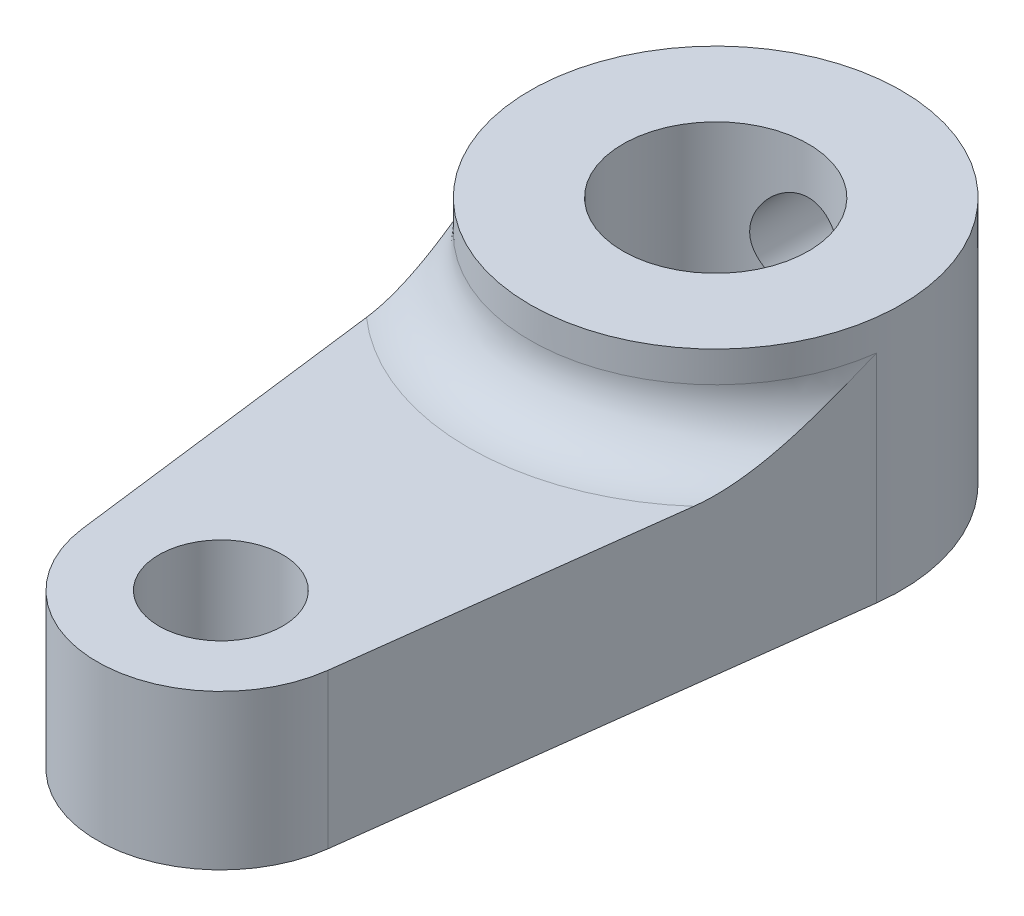
ISO-10303-21;
HEADER;
FILE_DESCRIPTION(('STEP AP214'),'2;1');
FILE_NAME('part.step','',(''),(''),'','','');
FILE_SCHEMA(('AUTOMOTIVE_DESIGN { 1 0 10303 214 1 1 1 1 }'));
ENDSEC;
DATA;
#1=APPLICATION_CONTEXT('core data for automotive mechanical design processes');
#2=APPLICATION_PROTOCOL_DEFINITION('international standard','automotive_design',2000,#1);
#3=PRODUCT_CONTEXT('',#1,'mechanical');
#4=PRODUCT('Part','Part','',(#3));
#5=PRODUCT_RELATED_PRODUCT_CATEGORY('part','',(#4));
#6=PRODUCT_DEFINITION_FORMATION('','',#4);
#7=PRODUCT_DEFINITION_CONTEXT('part definition',#1,'design');
#8=PRODUCT_DEFINITION('design','',#6,#7);
#9=PRODUCT_DEFINITION_SHAPE('','',#8);
#10=(LENGTH_UNIT() NAMED_UNIT(*) SI_UNIT(.MILLI.,.METRE.));
#11=(NAMED_UNIT(*) PLANE_ANGLE_UNIT() SI_UNIT($,.RADIAN.));
#12=(NAMED_UNIT(*) SI_UNIT($,.STERADIAN.) SOLID_ANGLE_UNIT());
#13=UNCERTAINTY_MEASURE_WITH_UNIT(LENGTH_MEASURE(1.E-05),#10,'distance_accuracy_value','');
#14=(GEOMETRIC_REPRESENTATION_CONTEXT(3) GLOBAL_UNCERTAINTY_ASSIGNED_CONTEXT((#13)) GLOBAL_UNIT_ASSIGNED_CONTEXT((#10,
#11,#12)) REPRESENTATION_CONTEXT('',''));
#15=CARTESIAN_POINT('',(0.,0.,0.));
#16=DIRECTION('',(0.,0.,1.));
#17=DIRECTION('',(1.,0.,0.));
#18=AXIS2_PLACEMENT_3D('',#15,#16,#17);
#19=CARTESIAN_POINT('',(-5.95294044989533,5.,0.750000000000001));
#20=DIRECTION('',(0.992156741649222,0.,-0.125));
#21=DIRECTION('',(-0.125,0.,-0.992156741649222));
#22=AXIS2_PLACEMENT_3D('',#19,#20,#21);
#23=PLANE('',#22);
#24=DIRECTION('',(0.125,0.,0.992156741649222));
#25=VECTOR('',#24,1.);
#26=CARTESIAN_POINT('',(-5.95294044989533,0.,0.750000000000001));
#27=LINE('',#26,#25);
#28=CARTESIAN_POINT('',(-5.95294044989533,0.,0.750000000000001));
#29=VERTEX_POINT('',#28);
#30=CARTESIAN_POINT('',(-3.96862696659688,0.,16.5));
#31=VERTEX_POINT('',#30);
#32=EDGE_CURVE('E177',#29,#31,#27,.T.);
#33=ORIENTED_EDGE('',*,*,#32,.T.);
#34=DIRECTION('',(0.,-1.,0.));
#35=VECTOR('',#34,1.);
#36=CARTESIAN_POINT('',(-3.96862696659688,5.,16.5));
#37=LINE('',#36,#35);
#38=CARTESIAN_POINT('',(-3.96862696659688,5.,16.5));
#39=VERTEX_POINT('',#38);
#40=EDGE_CURVE('E169',#39,#31,#37,.T.);
#41=ORIENTED_EDGE('',*,*,#40,.F.);
#42=DIRECTION('',(0.125,0.,0.992156741649222));
#43=VECTOR('',#42,1.);
#44=CARTESIAN_POINT('',(-5.95294044989533,5.,0.750000000000001));
#45=LINE('',#44,#43);
#46=CARTESIAN_POINT('',(-5.29150262212918,5.,6.00000000000001));
#47=VERTEX_POINT('',#46);
#48=EDGE_CURVE('E153',#47,#39,#45,.T.);
#49=ORIENTED_EDGE('',*,*,#48,.F.);
#50=CARTESIAN_POINT('',(-5.29150262212918,5.,6.));
#51=CARTESIAN_POINT('',(-5.31039781985104,5.00003932371851,5.85002401756371));
#52=CARTESIAN_POINT('',(-5.32927068108457,5.00749080861607,5.70022532550723));
#53=CARTESIAN_POINT('',(-5.3668298397168,5.03529748814452,5.40210874592607));
#54=CARTESIAN_POINT('',(-5.38551644968376,5.05562506504888,5.25378837746783));
#55=CARTESIAN_POINT('',(-5.42237695613113,5.10690972129888,4.96121717768887));
#56=CARTESIAN_POINT('',(-5.44055436264548,5.13771036698757,4.81693848633762));
#57=CARTESIAN_POINT('',(-5.47663555915596,5.20848018103613,4.53055286742049));
#58=CARTESIAN_POINT('',(-5.49453918362415,5.24845467894681,4.38844725369187));
#59=CARTESIAN_POINT('',(-5.55104862359349,5.38804779430905,3.93991747903271));
#60=CARTESIAN_POINT('',(-5.58909054596898,5.50228369716573,3.63796908103157));
#61=CARTESIAN_POINT('',(-5.66384180156036,5.75580816906752,3.04464938357773));
#62=CARTESIAN_POINT('',(-5.70054954085287,5.89512559194067,2.75329073549964));
#63=CARTESIAN_POINT('',(-5.80963672037306,6.33812108028194,1.88743809079183));
#64=CARTESIAN_POINT('',(-5.88048240155207,6.6653306727669,1.32511792920347));
#65=CARTESIAN_POINT('',(-5.95182241893323,6.99483605454595,0.758874095651361));
#66=CARTESIAN_POINT('',(-5.95238143594605,6.99741804396554,0.754437035667611));
#67=CARTESIAN_POINT('',(-5.95294044989533,7.,0.750000000000001));
#68=B_SPLINE_CURVE_WITH_KNOTS('',3,(#50,#51,#52,#53,#54,#55,#56,#57,#58,#59,#60,#61,#62,#63,#64,
#65,#66,#67),.UNSPECIFIED.,.F.,.F.,(4,2,2,2,2,2,2,2,4),(0.,0.453047985174652,0.905127510169083,
1.35073120961699,1.79659444088085,2.76988627914147,3.74430503334612,5.70583133706968,
5.72132327058451),.UNSPECIFIED.);
#69=CARTESIAN_POINT('',(-5.95294044989533,7.,0.750000000000001));
#70=VERTEX_POINT('',#69);
#71=EDGE_CURVE('E55',#47,#70,#68,.T.);
#72=ORIENTED_EDGE('',*,*,#71,.T.);
#73=DIRECTION('',(0.,-1.,0.));
#74=VECTOR('',#73,1.);
#75=CARTESIAN_POINT('',(-5.95294044989533,5.,0.750000000000001));
#76=LINE('',#75,#74);
#77=EDGE_CURVE('E357',#70,#29,#76,.T.);
#78=ORIENTED_EDGE('',*,*,#77,.T.);
#79=EDGE_LOOP('',(#33,#41,#49,#72,#78));
#80=FACE_BOUND('',#79,.T.);
#81=ADVANCED_FACE('F101',(#80),#23,.F.);
#82=CARTESIAN_POINT('',(0.,5.,16.));
#83=DIRECTION('',(0.,-1.,0.));
#84=DIRECTION('',(0.,0.,-1.));
#85=AXIS2_PLACEMENT_3D('',#82,#83,#84);
#86=CYLINDRICAL_SURFACE('',#85,4.);
#87=CARTESIAN_POINT('',(0.,0.,16.));
#88=DIRECTION('',(0.,1.,0.));
#89=DIRECTION('',(0.,0.,1.));
#90=AXIS2_PLACEMENT_3D('',#87,#88,#89);
#91=CIRCLE('',#90,4.);
#92=CARTESIAN_POINT('',(3.96862696659689,0.,16.5));
#93=VERTEX_POINT('',#92);
#94=EDGE_CURVE('E360',#31,#93,#91,.T.);
#95=ORIENTED_EDGE('',*,*,#94,.T.);
#96=DIRECTION('',(0.,-1.,0.));
#97=VECTOR('',#96,1.);
#98=CARTESIAN_POINT('',(3.96862696659689,5.,16.5));
#99=LINE('',#98,#97);
#100=CARTESIAN_POINT('',(3.96862696659689,5.,16.5));
#101=VERTEX_POINT('',#100);
#102=EDGE_CURVE('E171',#101,#93,#99,.T.);
#103=ORIENTED_EDGE('',*,*,#102,.F.);
#104=CARTESIAN_POINT('',(0.,5.,16.));
#105=DIRECTION('',(0.,1.,0.));
#106=DIRECTION('',(0.,0.,1.));
#107=AXIS2_PLACEMENT_3D('',#104,#105,#106);
#108=CIRCLE('',#107,4.);
#109=EDGE_CURVE('E157',#39,#101,#108,.T.);
#110=ORIENTED_EDGE('',*,*,#109,.F.);
#111=ORIENTED_EDGE('',*,*,#40,.T.);
#112=EDGE_LOOP('',(#95,#103,#110,#111));
#113=FACE_BOUND('',#112,.T.);
#114=ADVANCED_FACE('F168',(#113),#86,.T.);
#115=CARTESIAN_POINT('',(5.95294044989533,5.,0.75));
#116=DIRECTION('',(0.992156741649222,0.,0.125));
#117=DIRECTION('',(0.125,0.,-0.992156741649222));
#118=AXIS2_PLACEMENT_3D('',#115,#116,#117);
#119=PLANE('',#118);
#120=DIRECTION('',(-0.125,0.,0.992156741649222));
#121=VECTOR('',#120,1.);
#122=CARTESIAN_POINT('',(5.95294044989533,0.,0.75));
#123=LINE('',#122,#121);
#124=CARTESIAN_POINT('',(5.95294044989533,0.,0.749999999999999));
#125=VERTEX_POINT('',#124);
#126=EDGE_CURVE('E363',#125,#93,#123,.T.);
#127=ORIENTED_EDGE('',*,*,#126,.F.);
#128=DIRECTION('',(0.,-1.,0.));
#129=VECTOR('',#128,1.);
#130=CARTESIAN_POINT('',(5.95294044989533,5.,0.749999999999999));
#131=LINE('',#130,#129);
#132=CARTESIAN_POINT('',(5.95294044989533,7.,0.749999999999999));
#133=VERTEX_POINT('',#132);
#134=EDGE_CURVE('E185',#133,#125,#131,.T.);
#135=ORIENTED_EDGE('',*,*,#134,.F.);
#136=CARTESIAN_POINT('',(5.29150262212918,5.,6.));
#137=CARTESIAN_POINT('',(5.31039781985099,5.00003932371851,5.85002401756408));
#138=CARTESIAN_POINT('',(5.32927068108448,5.00749080861603,5.70022532550798));
#139=CARTESIAN_POINT('',(5.36682983971663,5.03529748814436,5.40210874592749));
#140=CARTESIAN_POINT('',(5.38551644968354,5.05562506504863,5.25378837746954));
#141=CARTESIAN_POINT('',(5.42237695613093,5.10690972129854,4.96121717769049));
#142=CARTESIAN_POINT('',(5.44055436264532,5.13771036698727,4.81693848633887));
#143=CARTESIAN_POINT('',(5.47663555915588,5.20848018103597,4.53055286742109));
#144=CARTESIAN_POINT('',(5.49453918362412,5.24845467894676,4.38844725369219));
#145=CARTESIAN_POINT('',(5.55104862359351,5.388047794309,3.93991747903255));
#146=CARTESIAN_POINT('',(5.58909054596904,5.50228369716535,3.6379690810311));
#147=CARTESIAN_POINT('',(5.6638418015604,5.75580816906824,3.0446493835774));
#148=CARTESIAN_POINT('',(5.70054954085285,5.89512559194285,2.75329073549978));
#149=CARTESIAN_POINT('',(5.80963672037343,6.33812108027884,1.88743809078903));
#150=CARTESIAN_POINT('',(5.88048240155358,6.66533067274761,1.32511792919187));
#151=CARTESIAN_POINT('',(5.95182241893326,6.99483605454567,0.75887409565114));
#152=CARTESIAN_POINT('',(5.95238143594606,6.9974180439654,0.7544370356675));
#153=CARTESIAN_POINT('',(5.95294044989533,7.,0.75));
#154=B_SPLINE_CURVE_WITH_KNOTS('',3,(#136,#137,#138,#139,#140,#141,#142,#143,#144,#145,#146,
#147,#148,#149,#150,#151,#152,#153),.UNSPECIFIED.,.F.,.F.,(4,2,2,2,2,2,2,2,4),(0.,
0.453047985173508,0.905127510167047,1.35073120961605,1.79659444088085,2.7698862791418,
3.74430503334741,5.70583133706976,5.72132327058452),.UNSPECIFIED.);
#155=CARTESIAN_POINT('',(5.29150262212918,5.,6.));
#156=VERTEX_POINT('',#155);
#157=EDGE_CURVE('E117',#133,#156,#154,.F.);
#158=ORIENTED_EDGE('',*,*,#157,.T.);
#159=DIRECTION('',(-0.125,0.,0.992156741649222));
#160=VECTOR('',#159,1.);
#161=CARTESIAN_POINT('',(5.95294044989533,5.,0.75));
#162=LINE('',#161,#160);
#163=EDGE_CURVE('E173',#156,#101,#162,.T.);
#164=ORIENTED_EDGE('',*,*,#163,.T.);
#165=ORIENTED_EDGE('',*,*,#102,.T.);
#166=EDGE_LOOP('',(#127,#135,#158,#164,#165));
#167=FACE_BOUND('',#166,.T.);
#168=ADVANCED_FACE('F201',(#167),#119,.T.);
#169=CARTESIAN_POINT('',(0.,5.,0.));
#170=DIRECTION('',(0.,-1.,0.));
#171=DIRECTION('',(0.,0.,-1.));
#172=AXIS2_PLACEMENT_3D('',#169,#170,#171);
#173=CYLINDRICAL_SURFACE('',#172,6.);
#174=CARTESIAN_POINT('',(0.,6.5,-6.));
#175=CARTESIAN_POINT('',(-0.082876088669731,6.49999767426184,-5.99999859868013));
#176=CARTESIAN_POINT('',(-0.165778157830763,6.49310844922621,-5.99826578131828));
#177=CARTESIAN_POINT('',(-0.329206323770532,6.46577484869299,-5.99152113829892));
#178=CARTESIAN_POINT('',(-0.409731046870739,6.44532279046215,-5.98650745419968));
#179=CARTESIAN_POINT('',(-0.566020872182576,6.39156074653791,-5.9737562633204));
#180=CARTESIAN_POINT('',(-0.641791563430002,6.35826620128472,-5.96602202842087));
#181=CARTESIAN_POINT('',(-0.786672131904425,6.27981860995517,-5.94865343807593));
#182=CARTESIAN_POINT('',(-0.855781784348758,6.23466516388106,-5.9390190185405));
#183=CARTESIAN_POINT('',(-0.986801927300918,6.13279921034579,-5.91867413591801));
#184=CARTESIAN_POINT('',(-1.04855569006107,6.07588842504082,-5.90794707148533));
#185=CARTESIAN_POINT('',(-1.1617489272033,5.95254779509108,-5.8867362011753));
#186=CARTESIAN_POINT('',(-1.21318723694913,5.8861168770535,-5.87625242288349));
#187=CARTESIAN_POINT('',(-1.30502654279903,5.74440477326256,-5.8565477569971));
#188=CARTESIAN_POINT('',(-1.34525221592536,5.6690067691896,-5.84734794470605));
#189=CARTESIAN_POINT('',(-1.41239690855053,5.51225158834164,-5.83149494812223));
#190=CARTESIAN_POINT('',(-1.43931805543933,5.43089536667424,-5.82484135672789));
#191=CARTESIAN_POINT('',(-1.47855483680429,5.26625650179752,-5.81500476717551));
#192=CARTESIAN_POINT('',(-1.49115226833334,5.1830451039502,-5.81175491075426));
#193=CARTESIAN_POINT('',(-1.50226177506785,5.01563143098602,-5.80889362537741));
#194=CARTESIAN_POINT('',(-1.50077614181798,4.93142931930139,-5.80928160448644));
#195=CARTESIAN_POINT('',(-1.48398652463928,4.76658419225552,-5.81359205496618));
#196=CARTESIAN_POINT('',(-1.46901834019052,4.6859043785349,-5.81742863001879));
#197=CARTESIAN_POINT('',(-1.4262241869031,4.52823894908871,-5.82806709676484));
#198=CARTESIAN_POINT('',(-1.39839730206942,4.45125359697102,-5.83486919970697));
#199=CARTESIAN_POINT('',(-1.33038947793715,4.30226198374793,-5.85075113904187));
#200=CARTESIAN_POINT('',(-1.29008666723291,4.23031382821045,-5.85985327469421));
#201=CARTESIAN_POINT('',(-1.19835627601495,4.09408129024316,-5.87929710846386));
#202=CARTESIAN_POINT('',(-1.14692674880884,4.02979825193274,-5.88963902334735));
#203=CARTESIAN_POINT('',(-1.03266342468122,3.9087963843056,-5.91075880539781));
#204=CARTESIAN_POINT('',(-0.969546258165858,3.85234550993865,-5.92154069477971));
#205=CARTESIAN_POINT('',(-0.834611917503699,3.7507787575361,-5.94205965578786));
#206=CARTESIAN_POINT('',(-0.762794477707943,3.70566322573644,-5.95179669549415));
#207=CARTESIAN_POINT('',(-0.612115888681391,3.62794941377562,-5.96917732094183));
#208=CARTESIAN_POINT('',(-0.533231393208623,3.59539465974557,-5.97681360127725));
#209=CARTESIAN_POINT('',(-0.370876008142882,3.54408269429043,-5.98907916991419));
#210=CARTESIAN_POINT('',(-0.287405999150484,3.52532284358186,-5.99370903339281));
#211=CARTESIAN_POINT('',(-0.120539970390027,3.50254243444116,-5.99935499271375));
#212=CARTESIAN_POINT('',(-0.0371967199882097,3.4981569739247,-6.00046053508279));
#213=CARTESIAN_POINT('',(0.129032874801508,3.50324900205549,-5.99918804814451));
#214=CARTESIAN_POINT('',(0.211919259644595,3.51272524279913,-5.99681033241847));
#215=CARTESIAN_POINT('',(0.373614268776491,3.54497090839138,-5.98889581127357));
#216=CARTESIAN_POINT('',(0.452465118968754,3.56754126347699,-5.98340634185811));
#217=CARTESIAN_POINT('',(0.605257292452511,3.62510708402845,-5.96988706634134));
#218=CARTESIAN_POINT('',(0.679198119032634,3.66010380431317,-5.96185700369892));
#219=CARTESIAN_POINT('',(0.821523134429846,3.74223612887473,-5.9439330792631));
#220=CARTESIAN_POINT('',(0.889785441835829,3.78957611239676,-5.93400867366932));
#221=CARTESIAN_POINT('',(1.01752661364324,3.89478990879697,-5.91344509187419));
#222=CARTESIAN_POINT('',(1.07700395897301,3.95266553961691,-5.90280579251705));
#223=CARTESIAN_POINT('',(1.18699056807273,4.07900196084447,-5.88168956960771));
#224=CARTESIAN_POINT('',(1.23724386762203,4.14768770300242,-5.87122304187281));
#225=CARTESIAN_POINT('',(1.3255107590127,4.29273263446572,-5.85192878377239));
#226=CARTESIAN_POINT('',(1.36352489415793,4.36909148295975,-5.84310098067026));
#227=CARTESIAN_POINT('',(1.42595142060929,4.52690572241308,-5.82818094734665));
#228=CARTESIAN_POINT('',(1.45044439665406,4.60832762834401,-5.82207255291906));
#229=CARTESIAN_POINT('',(1.48534565995378,4.77430963788911,-5.81326744090184));
#230=CARTESIAN_POINT('',(1.49575702747866,4.85886905103249,-5.81056997719936));
#231=CARTESIAN_POINT('',(1.50203859033399,5.0261210238552,-5.80894901203957));
#232=CARTESIAN_POINT('',(1.49831789778012,5.10879743512473,-5.80991932728264));
#233=CARTESIAN_POINT('',(1.47737727831287,5.27230388866798,-5.81527909007843));
#234=CARTESIAN_POINT('',(1.46015762268677,5.35313396801365,-5.81966846891857));
#235=CARTESIAN_POINT('',(1.41293131944279,5.51020845906541,-5.83131260682722));
#236=CARTESIAN_POINT('',(1.38300140468037,5.58647730524021,-5.83855015236309));
#237=CARTESIAN_POINT('',(1.31126491360507,5.73296538271369,-5.85507755724829));
#238=CARTESIAN_POINT('',(1.26945669003419,5.80318377318691,-5.86436770120773));
#239=CARTESIAN_POINT('',(1.17386774863714,5.93755462900202,-5.88425634263512));
#240=CARTESIAN_POINT('',(1.11980316291225,6.00150107342396,-5.89488264831757));
#241=CARTESIAN_POINT('',(1.00178937118973,6.11954704479541,-5.91608027246286));
#242=CARTESIAN_POINT('',(0.937837821261145,6.17364423011297,-5.9266515772706));
#243=CARTESIAN_POINT('',(0.80046758670259,6.27141130856461,-5.94677655647663));
#244=CARTESIAN_POINT('',(0.726898422316386,6.31487461367158,-5.95630833365868));
#245=CARTESIAN_POINT('',(0.573266059510476,6.38874746294053,-5.97304924975118));
#246=CARTESIAN_POINT('',(0.493207563436739,6.41916636064853,-5.98026005199781));
#247=CARTESIAN_POINT('',(0.344410253243472,6.46157183032965,-5.99048059565542));
#248=CARTESIAN_POINT('',(0.276380170908069,6.47595124305343,-5.99402585052691));
#249=CARTESIAN_POINT('',(0.138906071536283,6.49516594362194,-5.99878605231948));
#250=CARTESIAN_POINT('',(0.0694621612426163,6.5000019493053,-6.00000117450894));
#251=CARTESIAN_POINT('',(0.,6.5,-6.));
#252=B_SPLINE_CURVE_WITH_KNOTS('',3,(#174,#175,#176,#177,#178,#179,#180,#181,#182,#183,#184,
#185,#186,#187,#188,#189,#190,#191,#192,#193,#194,#195,#196,#197,#198,#199,#200,#201,#202,#203,
#204,#205,#206,#207,#208,#209,#210,#211,#212,#213,#214,#215,#216,#217,#218,#219,#220,#221,#222,
#223,#224,#225,#226,#227,#228,#229,#230,#231,#232,#233,#234,#235,#236,#237,#238,#239,#240,#241,
#242,#243,#244,#245,#246,#247,#248,#249,#250,#251),.UNSPECIFIED.,.T.,.F.,(4,2,2,2,2,2,2,2,2,2,2,
2,2,2,2,2,2,2,2,2,2,2,2,2,2,2,2,2,2,2,2,2,2,2,2,2,2,2,4),(0.,0.248373712471889,
0.496888237763899,0.745104902286104,0.993329940169327,1.24614435437139,1.49898729580062,
1.75558647545807,2.01214461169368,2.2635629509943,2.51494038112697,2.76022497007018,
3.00552703466038,3.25330527873879,3.50112690836162,3.75601500969019,4.01091089558247,
4.26668229009114,4.52240473688642,4.77158308949276,5.02073901112742,5.26620274514037,
5.5116912732229,5.76153587565351,6.01142363008018,6.26744509204475,6.52345518749507,
6.77792254614035,7.03233423252407,7.27943780398612,7.52653640956033,7.77216400559446,
8.017825681369,8.26989576409909,8.52202569770417,8.77872185499587,9.03523363821349,
9.24342242942148,9.45159556043038),.UNSPECIFIED.);
#253=CARTESIAN_POINT('',(0.,6.5,-6.));
#254=VERTEX_POINT('',#253);
#255=EDGE_CURVE('E106',#254,#254,#252,.T.);
#256=ORIENTED_EDGE('',*,*,#255,.T.);
#257=EDGE_LOOP('',(#256));
#258=FACE_BOUND('',#257,.T.);
#259=CARTESIAN_POINT('',(0.,7.,0.));
#260=DIRECTION('',(0.,1.,0.));
#261=DIRECTION('',(0.,0.,1.));
#262=AXIS2_PLACEMENT_3D('',#259,#260,#261);
#263=CIRCLE('',#262,6.);
#264=EDGE_CURVE('E179',#70,#133,#263,.T.);
#265=ORIENTED_EDGE('',*,*,#264,.T.);
#266=ORIENTED_EDGE('',*,*,#134,.T.);
#267=CARTESIAN_POINT('',(0.,0.,0.));
#268=DIRECTION('',(0.,1.,0.));
#269=DIRECTION('',(0.,0.,1.));
#270=AXIS2_PLACEMENT_3D('',#267,#268,#269);
#271=CIRCLE('',#270,6.);
#272=EDGE_CURVE('E367',#125,#29,#271,.T.);
#273=ORIENTED_EDGE('',*,*,#272,.T.);
#274=ORIENTED_EDGE('',*,*,#77,.F.);
#275=EDGE_LOOP('',(#265,#266,#273,#274));
#276=FACE_BOUND('',#275,.T.);
#277=CARTESIAN_POINT('',(0.,8.,0.));
#278=DIRECTION('',(0.,1.,0.));
#279=DIRECTION('',(0.,0.,1.));
#280=AXIS2_PLACEMENT_3D('',#277,#278,#279);
#281=CIRCLE('',#280,6.);
#282=CARTESIAN_POINT('',(0.,8.,6.));
#283=VERTEX_POINT('',#282);
#284=EDGE_CURVE('E344',#283,#283,#281,.T.);
#285=ORIENTED_EDGE('',*,*,#284,.F.);
#286=EDGE_LOOP('',(#285));
#287=FACE_BOUND('',#286,.T.);
#288=ADVANCED_FACE('F205',(#258,#276,#287),#173,.T.);
#289=CARTESIAN_POINT('',(0.,5.,16.));
#290=DIRECTION('',(0.,-1.,0.));
#291=DIRECTION('',(0.,0.,-1.));
#292=AXIS2_PLACEMENT_3D('',#289,#290,#291);
#293=CYLINDRICAL_SURFACE('',#292,2.);
#294=CARTESIAN_POINT('',(0.,5.,16.));
#295=DIRECTION('',(0.,1.,0.));
#296=DIRECTION('',(0.,0.,1.));
#297=AXIS2_PLACEMENT_3D('',#294,#295,#296);
#298=CIRCLE('',#297,2.);
#299=CARTESIAN_POINT('',(0.,5.,18.));
#300=VERTEX_POINT('',#299);
#301=EDGE_CURVE('E353',#300,#300,#298,.T.);
#302=ORIENTED_EDGE('',*,*,#301,.T.);
#303=EDGE_LOOP('',(#302));
#304=FACE_BOUND('',#303,.T.);
#305=CARTESIAN_POINT('',(0.,0.,16.));
#306=DIRECTION('',(0.,1.,0.));
#307=DIRECTION('',(0.,0.,1.));
#308=AXIS2_PLACEMENT_3D('',#305,#306,#307);
#309=CIRCLE('',#308,2.);
#310=CARTESIAN_POINT('',(0.,0.,18.));
#311=VERTEX_POINT('',#310);
#312=EDGE_CURVE('E163',#311,#311,#309,.T.);
#313=ORIENTED_EDGE('',*,*,#312,.F.);
#314=EDGE_LOOP('',(#313));
#315=FACE_BOUND('',#314,.T.);
#316=ADVANCED_FACE('F229',(#304,#315),#293,.F.);
#317=CARTESIAN_POINT('',(0.,5.,0.));
#318=DIRECTION('',(0.,1.,0.));
#319=DIRECTION('',(0.,0.,1.));
#320=AXIS2_PLACEMENT_3D('',#317,#318,#319);
#321=PLANE('',#320);
#322=ORIENTED_EDGE('',*,*,#163,.F.);
#323=CARTESIAN_POINT('',(0.,5.,0.));
#324=DIRECTION('',(0.,1.,0.));
#325=DIRECTION('',(0.,0.,1.));
#326=AXIS2_PLACEMENT_3D('',#323,#324,#325);
#327=CIRCLE('',#326,8.);
#328=EDGE_CURVE('E130',#156,#47,#327,.F.);
#329=ORIENTED_EDGE('',*,*,#328,.T.);
#330=ORIENTED_EDGE('',*,*,#48,.T.);
#331=ORIENTED_EDGE('',*,*,#109,.T.);
#332=EDGE_LOOP('',(#322,#329,#330,#331));
#333=FACE_BOUND('',#332,.T.);
#334=ORIENTED_EDGE('',*,*,#301,.F.);
#335=EDGE_LOOP('',(#334));
#336=FACE_BOUND('',#335,.T.);
#337=ADVANCED_FACE('F155',(#333,#336),#321,.T.);
#338=CARTESIAN_POINT('',(0.,0.,0.));
#339=DIRECTION('',(0.,1.,0.));
#340=DIRECTION('',(0.,0.,1.));
#341=AXIS2_PLACEMENT_3D('',#338,#339,#340);
#342=PLANE('',#341);
#343=CARTESIAN_POINT('',(0.,0.,0.));
#344=DIRECTION('',(0.,1.,0.));
#345=DIRECTION('',(0.,0.,1.));
#346=AXIS2_PLACEMENT_3D('',#343,#344,#345);
#347=CIRCLE('',#346,3.);
#348=CARTESIAN_POINT('',(0.,0.,3.));
#349=VERTEX_POINT('',#348);
#350=EDGE_CURVE('E340',#349,#349,#347,.T.);
#351=ORIENTED_EDGE('',*,*,#350,.T.);
#352=EDGE_LOOP('',(#351));
#353=FACE_BOUND('',#352,.T.);
#354=ORIENTED_EDGE('',*,*,#32,.F.);
#355=ORIENTED_EDGE('',*,*,#272,.F.);
#356=ORIENTED_EDGE('',*,*,#126,.T.);
#357=ORIENTED_EDGE('',*,*,#94,.F.);
#358=EDGE_LOOP('',(#354,#355,#356,#357));
#359=FACE_BOUND('',#358,.T.);
#360=ORIENTED_EDGE('',*,*,#312,.T.);
#361=EDGE_LOOP('',(#360));
#362=FACE_BOUND('',#361,.T.);
#363=ADVANCED_FACE('F242',(#353,#359,#362),#342,.F.);
#364=CARTESIAN_POINT('',(0.,8.,0.));
#365=DIRECTION('',(0.,1.,0.));
#366=DIRECTION('',(0.,0.,1.));
#367=AXIS2_PLACEMENT_3D('',#364,#365,#366);
#368=PLANE('',#367);
#369=CARTESIAN_POINT('',(0.,8.,0.));
#370=DIRECTION('',(0.,1.,0.));
#371=DIRECTION('',(0.,0.,1.));
#372=AXIS2_PLACEMENT_3D('',#369,#370,#371);
#373=CIRCLE('',#372,3.);
#374=CARTESIAN_POINT('',(0.,8.,3.));
#375=VERTEX_POINT('',#374);
#376=EDGE_CURVE('E339',#375,#375,#373,.T.);
#377=ORIENTED_EDGE('',*,*,#376,.F.);
#378=EDGE_LOOP('',(#377));
#379=FACE_BOUND('',#378,.T.);
#380=ORIENTED_EDGE('',*,*,#284,.T.);
#381=EDGE_LOOP('',(#380));
#382=FACE_BOUND('',#381,.T.);
#383=ADVANCED_FACE('F250',(#379,#382),#368,.T.);
#384=CARTESIAN_POINT('',(0.,7.,0.));
#385=DIRECTION('',(0.,1.,0.));
#386=DIRECTION('',(0.,0.,1.));
#387=AXIS2_PLACEMENT_3D('',#384,#385,#386);
#388=TOROIDAL_SURFACE('',#387,8.,2.);
#389=ORIENTED_EDGE('',*,*,#71,.F.);
#390=ORIENTED_EDGE('',*,*,#328,.F.);
#391=ORIENTED_EDGE('',*,*,#157,.F.);
#392=ORIENTED_EDGE('',*,*,#264,.F.);
#393=EDGE_LOOP('',(#389,#390,#391,#392));
#394=FACE_BOUND('',#393,.T.);
#395=ADVANCED_FACE('F103',(#394),#388,.F.);
#396=CARTESIAN_POINT('',(0.,0.,0.));
#397=DIRECTION('',(0.,1.,0.));
#398=DIRECTION('',(0.,0.,1.));
#399=AXIS2_PLACEMENT_3D('',#396,#397,#398);
#400=CYLINDRICAL_SURFACE('',#399,3.);
#401=CARTESIAN_POINT('',(-1.5,5.,-2.59807621135332));
#402=CARTESIAN_POINT('',(-1.4999945446118,5.07816171229288,-2.59808302092689));
#403=CARTESIAN_POINT('',(-1.49384995609982,5.15642211728757,-2.60165701781635));
#404=CARTESIAN_POINT('',(-1.46958481484708,5.31054089701573,-2.61543549678079));
#405=CARTESIAN_POINT('',(-1.45143909683127,5.38639387256511,-2.62565391083339));
#406=CARTESIAN_POINT('',(-1.40414992304972,5.53317749651591,-2.65124019908098));
#407=CARTESIAN_POINT('',(-1.37506492874059,5.60413197871038,-2.66658065209878));
#408=CARTESIAN_POINT('',(-1.30690128806456,5.74013630299508,-2.70063997225287));
#409=CARTESIAN_POINT('',(-1.26782210105366,5.80518582539369,-2.71935902214097));
#410=CARTESIAN_POINT('',(-1.17699981079632,5.93345859283626,-2.75995303586162));
#411=CARTESIAN_POINT('',(-1.12447805421565,5.99608870351031,-2.7819609545693));
#412=CARTESIAN_POINT('',(-1.0098807114217,6.11211258261006,-2.82557974178559));
#413=CARTESIAN_POINT('',(-0.947800388673438,6.16550174387528,-2.84719040746875));
#414=CARTESIAN_POINT('',(-0.810734345121818,6.26505072672149,-2.88932215429424));
#415=CARTESIAN_POINT('',(-0.735160783518861,6.31048065178929,-2.90967159627259));
#416=CARTESIAN_POINT('',(-0.576235539899255,6.38771127986864,-2.94526134149294));
#417=CARTESIAN_POINT('',(-0.492888807207232,6.41952058420575,-2.96050486775612));
#418=CARTESIAN_POINT('',(-0.327067415888965,6.46625699195164,-2.98320691866356));
#419=CARTESIAN_POINT('',(-0.244952685733225,6.4822242895333,-2.99114220331338));
#420=CARTESIAN_POINT('',(-0.0788559430467717,6.50024917801256,-3.00011375769101));
#421=CARTESIAN_POINT('',(0.00512490876560808,6.50231518519356,-3.00115420176885));
#422=CARTESIAN_POINT('',(0.164748786635625,6.49287998904447,-2.99644472874675));
#423=CARTESIAN_POINT('',(0.240481798765187,6.48254297671816,-2.99127743838241));
#424=CARTESIAN_POINT('',(0.388970657877483,6.45067873414301,-2.97561367889621));
#425=CARTESIAN_POINT('',(0.461726281640888,6.42915066653566,-2.96511681099591));
#426=CARTESIAN_POINT('',(0.60346408735433,6.37537615086528,-2.93957374931482));
#427=CARTESIAN_POINT('',(0.672380135272768,6.3429855302419,-2.92446662293799));
#428=CARTESIAN_POINT('',(0.803965202269992,6.26860487569776,-2.89106468980031));
#429=CARTESIAN_POINT('',(0.866631973257968,6.22661140504647,-2.87276874236226));
#430=CARTESIAN_POINT('',(0.990260491347292,6.12965697270048,-2.83266591598844));
#431=CARTESIAN_POINT('',(1.05050111254404,6.07384545751098,-2.81069063997263));
#432=CARTESIAN_POINT('',(1.16115655544667,5.95311541260473,-2.76681510880218));
#433=CARTESIAN_POINT('',(1.21156381736135,5.8881899415889,-2.74491492398443));
#434=CARTESIAN_POINT('',(1.30425800196332,5.74602771136387,-2.70216234138727));
#435=CARTESIAN_POINT('',(1.34582597246708,5.66827096541868,-2.68146479986061));
#436=CARTESIAN_POINT('',(1.41497866950185,5.5055934929615,-2.64563175417864));
#437=CARTESIAN_POINT('',(1.44257798731633,5.42068035047366,-2.63049045069101));
#438=CARTESIAN_POINT('',(1.48077031653756,5.25317823307581,-2.60916953725552));
#439=CARTESIAN_POINT('',(1.49253768317996,5.17093832143467,-2.60237483772745));
#440=CARTESIAN_POINT('',(1.50227541991714,5.00539798772519,-2.59676879042414));
#441=CARTESIAN_POINT('',(1.50025553597254,4.92209835632032,-2.59795180333967));
#442=CARTESIAN_POINT('',(1.48355406501595,4.76651912213191,-2.60751504810877));
#443=CARTESIAN_POINT('',(1.4702817250687,4.69403082333811,-2.61509381259981));
#444=CARTESIAN_POINT('',(1.43354442694866,4.55244832059356,-2.63541032327012));
#445=CARTESIAN_POINT('',(1.41007616793542,4.48335522388009,-2.64814974007551));
#446=CARTESIAN_POINT('',(1.35247138290733,4.34688300364596,-2.67804333119485));
#447=CARTESIAN_POINT('',(1.31789109553908,4.27973147471967,-2.69537464864595));
#448=CARTESIAN_POINT('',(1.2394305960237,4.15179609269151,-2.73234179245875));
#449=CARTESIAN_POINT('',(1.19554560649832,4.09101553473007,-2.75197880032721));
#450=CARTESIAN_POINT('',(1.09325575079828,3.96953184871468,-2.79431997684504));
#451=CARTESIAN_POINT('',(1.03371790847245,3.90980427392351,-2.81709874731434));
#452=CARTESIAN_POINT('',(0.905106743097431,3.80088164300961,-2.86101352466839));
#453=CARTESIAN_POINT('',(0.836030211983019,3.75169014465419,-2.88214897511564));
#454=CARTESIAN_POINT('',(0.687803043838134,3.66413941107485,-2.92112042536435));
#455=CARTESIAN_POINT('',(0.608434646361169,3.62610032268364,-2.93885462508044));
#456=CARTESIAN_POINT('',(0.443283546961622,3.56429314421391,-2.96825032438952));
#457=CARTESIAN_POINT('',(0.357506552088263,3.54051252295054,-2.9799171551456));
#458=CARTESIAN_POINT('',(0.190469523495625,3.50994715373801,-2.99501262272824));
#459=CARTESIAN_POINT('',(0.109517165775684,3.50180318618583,-2.99909891862287));
#460=CARTESIAN_POINT('',(-0.0526889789268062,3.4987351018184,-3.00063195562697));
#461=CARTESIAN_POINT('',(-0.133942650442631,3.50380635721466,-2.99808102100335));
#462=CARTESIAN_POINT('',(-0.288806988475721,3.52612461019344,-2.98700953256884));
#463=CARTESIAN_POINT('',(-0.362568476716896,3.54254727388651,-2.97889342001985));
#464=CARTESIAN_POINT('',(-0.506168928275426,3.58599049895446,-2.95788140495135));
#465=CARTESIAN_POINT('',(-0.576007327433263,3.61301258014018,-2.94498481699194));
#466=CARTESIAN_POINT('',(-0.713135109367327,3.67809057824896,-2.9148889612218));
#467=CARTESIAN_POINT('',(-0.780187714050069,3.71656898481176,-2.89752925798199));
#468=CARTESIAN_POINT('',(-0.907161962721036,3.80293689628858,-2.86032199712739));
#469=CARTESIAN_POINT('',(-0.96708031112236,3.85083072367351,-2.84047329837541));
#470=CARTESIAN_POINT('',(-1.08437100623534,3.96019570853406,-2.79792915339941));
#471=CARTESIAN_POINT('',(-1.14089652680891,4.02254373121579,-2.77514698517547));
#472=CARTESIAN_POINT('',(-1.24299493109201,4.15617608169466,-2.73094614244279));
#473=CARTESIAN_POINT('',(-1.28855812501509,4.22746823130153,-2.70952868642798));
#474=CARTESIAN_POINT('',(-1.36864661967848,4.37995496987144,-2.66999407957374));
#475=CARTESIAN_POINT('',(-1.40277759894141,4.46139129669311,-2.65200261384405));
#476=CARTESIAN_POINT('',(-1.45631806425962,4.62999860650967,-2.62299234492527));
#477=CARTESIAN_POINT('',(-1.47577678676302,4.71714933336903,-2.61195024221553));
#478=CARTESIAN_POINT('',(-1.49155051179662,4.837708033478,-2.60293908902686));
#479=CARTESIAN_POINT('',(-1.49471415744577,4.87005184159683,-2.60112193507728));
#480=CARTESIAN_POINT('',(-1.49894010763494,4.93492472102337,-2.59868903831625));
#481=CARTESIAN_POINT('',(-1.5000022715998,4.96745380457881,-2.59807337587664));
#482=CARTESIAN_POINT('',(-1.5,5.,-2.59807621135332));
#483=B_SPLINE_CURVE_WITH_KNOTS('',3,(#401,#402,#403,#404,#405,#406,#407,#408,#409,#410,#411,
#412,#413,#414,#415,#416,#417,#418,#419,#420,#421,#422,#423,#424,#425,#426,#427,#428,#429,#430,
#431,#432,#433,#434,#435,#436,#437,#438,#439,#440,#441,#442,#443,#444,#445,#446,#447,#448,#449,
#450,#451,#452,#453,#454,#455,#456,#457,#458,#459,#460,#461,#462,#463,#464,#465,#466,#467,#468,
#469,#470,#471,#472,#473,#474,#475,#476,#477,#478,#479,#480,#481,#482),.UNSPECIFIED.,.T.,.F.,(4,
2,2,2,2,2,2,2,2,2,2,2,2,2,2,2,2,2,2,2,2,2,2,2,2,2,2,2,2,2,2,2,2,2,2,2,2,2,2,2,4),(0.,
0.234348183892072,0.469189339237207,0.702792893878328,0.936409088167724,1.18929346874735,
1.44230356626556,1.71236838358145,1.98226240445836,2.23295227451903,2.4834903552906,
2.71224146226807,2.94100968776182,3.1729430209672,3.40495949025407,3.65890787185336,
3.91305072368878,4.18333262594172,4.45333161317557,4.70193436281317,4.95036139782559,
5.17161275136038,5.39293578654094,5.62450944609131,5.8562022933007,6.11710115370919,
6.37808797467303,6.64596272119448,6.91360169713157,7.15668405584229,7.39968130190957,
7.62666637307238,7.85368400268019,8.09041126079207,8.32724745151078,8.587653627751,
8.8482891426773,9.11716123557906,9.38512699504139,9.48270202777963,9.5802835874181),.UNSPECIFIED.);
#484=CARTESIAN_POINT('',(-1.5,5.,-2.59807621135332));
#485=VERTEX_POINT('',#484);
#486=EDGE_CURVE('E332',#485,#485,#483,.T.);
#487=ORIENTED_EDGE('',*,*,#486,.T.);
#488=EDGE_LOOP('',(#487));
#489=FACE_BOUND('',#488,.T.);
#490=ORIENTED_EDGE('',*,*,#350,.F.);
#491=EDGE_LOOP('',(#490));
#492=FACE_BOUND('',#491,.T.);
#493=ORIENTED_EDGE('',*,*,#376,.T.);
#494=EDGE_LOOP('',(#493));
#495=FACE_BOUND('',#494,.T.);
#496=ADVANCED_FACE('F263',(#489,#492,#495),#400,.F.);
#497=CARTESIAN_POINT('',(0.,5.,-8.1903036601085));
#498=DIRECTION('',(0.,0.,-1.));
#499=DIRECTION('',(-1.,0.,0.));
#500=AXIS2_PLACEMENT_3D('',#497,#498,#499);
#501=CYLINDRICAL_SURFACE('',#500,1.5);
#502=ORIENTED_EDGE('',*,*,#255,.F.);
#503=EDGE_LOOP('',(#502));
#504=FACE_BOUND('',#503,.T.);
#505=ORIENTED_EDGE('',*,*,#486,.F.);
#506=EDGE_LOOP('',(#505));
#507=FACE_BOUND('',#506,.T.);
#508=ADVANCED_FACE('F269',(#504,#507),#501,.F.);
#509=CLOSED_SHELL('',(#81,#114,#168,#288,#316,#337,#363,#383,#395,#496,#508));
#510=MANIFOLD_SOLID_BREP('B6',#509);
#511=ADVANCED_BREP_SHAPE_REPRESENTATION('',(#18,#510),#14);
#512=SHAPE_DEFINITION_REPRESENTATION(#9,#511);
ENDSEC;
END-ISO-10303-21;
